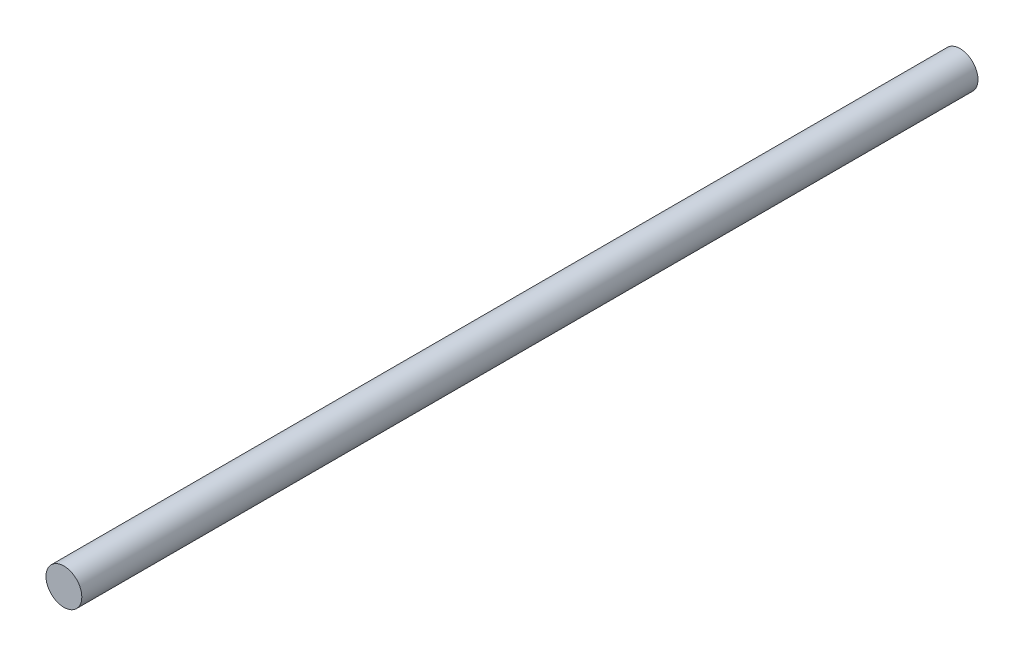
ISO-10303-21;
HEADER;
FILE_DESCRIPTION(('STEP AP214'),'2;1');
FILE_NAME('part.step','',(''),(''),'','','');
FILE_SCHEMA(('AUTOMOTIVE_DESIGN { 1 0 10303 214 1 1 1 1 }'));
ENDSEC;
DATA;
#1=APPLICATION_CONTEXT('core data for automotive mechanical design processes');
#2=APPLICATION_PROTOCOL_DEFINITION('international standard','automotive_design',2000,#1);
#3=PRODUCT_CONTEXT('',#1,'mechanical');
#4=PRODUCT('Part','Part','',(#3));
#5=PRODUCT_RELATED_PRODUCT_CATEGORY('part','',(#4));
#6=PRODUCT_DEFINITION_FORMATION('','',#4);
#7=PRODUCT_DEFINITION_CONTEXT('part definition',#1,'design');
#8=PRODUCT_DEFINITION('design','',#6,#7);
#9=PRODUCT_DEFINITION_SHAPE('','',#8);
#10=(LENGTH_UNIT() NAMED_UNIT(*) SI_UNIT(.MILLI.,.METRE.));
#11=(NAMED_UNIT(*) PLANE_ANGLE_UNIT() SI_UNIT($,.RADIAN.));
#12=(NAMED_UNIT(*) SI_UNIT($,.STERADIAN.) SOLID_ANGLE_UNIT());
#13=UNCERTAINTY_MEASURE_WITH_UNIT(LENGTH_MEASURE(1.E-05),#10,'distance_accuracy_value','');
#14=(GEOMETRIC_REPRESENTATION_CONTEXT(3) GLOBAL_UNCERTAINTY_ASSIGNED_CONTEXT((#13)) GLOBAL_UNIT_ASSIGNED_CONTEXT((#10,
#11,#12)) REPRESENTATION_CONTEXT('',''));
#15=CARTESIAN_POINT('',(0.,0.,0.));
#16=DIRECTION('',(0.,0.,1.));
#17=DIRECTION('',(1.,0.,0.));
#18=AXIS2_PLACEMENT_3D('',#15,#16,#17);
#19=CARTESIAN_POINT('',(0.,0.,300.));
#20=DIRECTION('',(0.,0.,-1.));
#21=DIRECTION('',(-1.,0.,0.));
#22=AXIS2_PLACEMENT_3D('',#19,#20,#21);
#23=CYLINDRICAL_SURFACE('',#22,6.);
#24=CARTESIAN_POINT('',(0.,0.,300.));
#25=DIRECTION('',(0.,0.,1.));
#26=DIRECTION('',(1.,0.,0.));
#27=AXIS2_PLACEMENT_3D('',#24,#25,#26);
#28=CIRCLE('',#27,6.);
#29=CARTESIAN_POINT('',(6.,0.,300.));
#30=VERTEX_POINT('',#29);
#31=EDGE_CURVE('E10',#30,#30,#28,.T.);
#32=ORIENTED_EDGE('',*,*,#31,.F.);
#33=EDGE_LOOP('',(#32));
#34=FACE_BOUND('',#33,.T.);
#35=CARTESIAN_POINT('',(0.,0.,0.));
#36=DIRECTION('',(0.,0.,1.));
#37=DIRECTION('',(1.,0.,0.));
#38=AXIS2_PLACEMENT_3D('',#35,#36,#37);
#39=CIRCLE('',#38,6.);
#40=CARTESIAN_POINT('',(6.,0.,0.));
#41=VERTEX_POINT('',#40);
#42=EDGE_CURVE('E39',#41,#41,#39,.T.);
#43=ORIENTED_EDGE('',*,*,#42,.T.);
#44=EDGE_LOOP('',(#43));
#45=FACE_BOUND('',#44,.T.);
#46=ADVANCED_FACE('F36',(#34,#45),#23,.T.);
#47=CARTESIAN_POINT('',(0.,0.,300.));
#48=DIRECTION('',(0.,0.,1.));
#49=DIRECTION('',(1.,0.,0.));
#50=AXIS2_PLACEMENT_3D('',#47,#48,#49);
#51=PLANE('',#50);
#52=ORIENTED_EDGE('',*,*,#31,.T.);
#53=EDGE_LOOP('',(#52));
#54=FACE_BOUND('',#53,.T.);
#55=ADVANCED_FACE('F51',(#54),#51,.T.);
#56=CARTESIAN_POINT('',(0.,0.,0.));
#57=DIRECTION('',(0.,0.,1.));
#58=DIRECTION('',(1.,0.,0.));
#59=AXIS2_PLACEMENT_3D('',#56,#57,#58);
#60=PLANE('',#59);
#61=ORIENTED_EDGE('',*,*,#42,.F.);
#62=EDGE_LOOP('',(#61));
#63=FACE_BOUND('',#62,.T.);
#64=ADVANCED_FACE('F49',(#63),#60,.F.);
#65=CLOSED_SHELL('',(#46,#55,#64));
#66=MANIFOLD_SOLID_BREP('B2',#65);
#67=ADVANCED_BREP_SHAPE_REPRESENTATION('',(#18,#66),#14);
#68=SHAPE_DEFINITION_REPRESENTATION(#9,#67);
ENDSEC;
END-ISO-10303-21;
